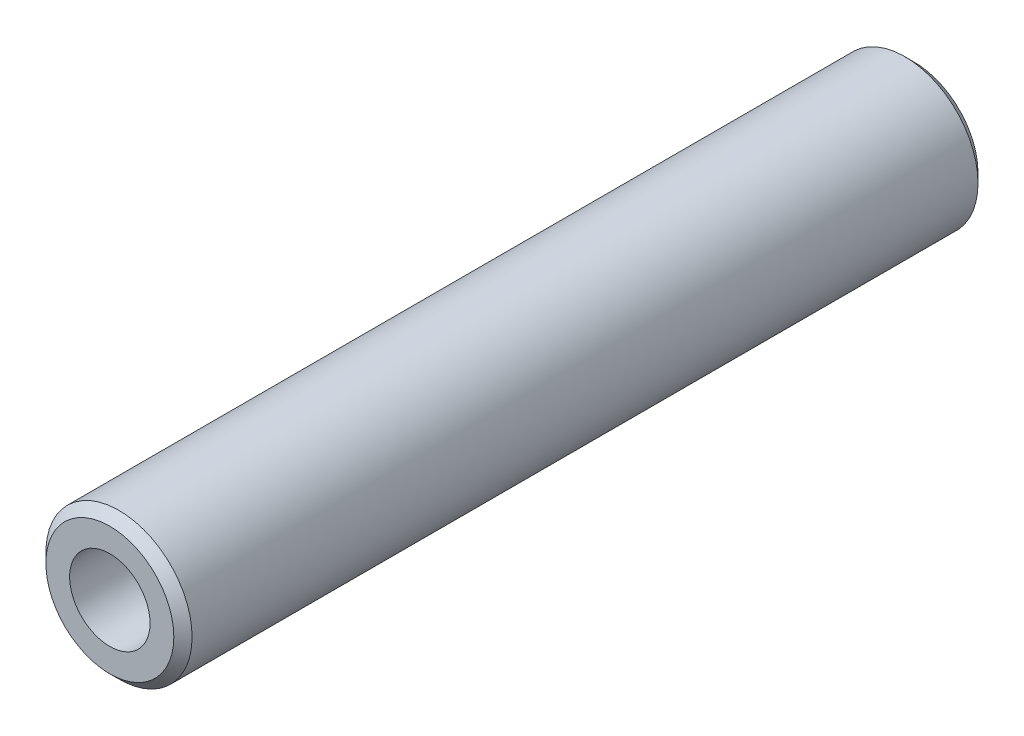
ISO-10303-21;
HEADER;
FILE_DESCRIPTION(('STEP AP214'),'2;1');
FILE_NAME('part.step','',(''),(''),'','','');
FILE_SCHEMA(('AUTOMOTIVE_DESIGN { 1 0 10303 214 1 1 1 1 }'));
ENDSEC;
DATA;
#1=APPLICATION_CONTEXT('core data for automotive mechanical design processes');
#2=APPLICATION_PROTOCOL_DEFINITION('international standard','automotive_design',2000,#1);
#3=PRODUCT_CONTEXT('',#1,'mechanical');
#4=PRODUCT('Part','Part','',(#3));
#5=PRODUCT_RELATED_PRODUCT_CATEGORY('part','',(#4));
#6=PRODUCT_DEFINITION_FORMATION('','',#4);
#7=PRODUCT_DEFINITION_CONTEXT('part definition',#1,'design');
#8=PRODUCT_DEFINITION('design','',#6,#7);
#9=PRODUCT_DEFINITION_SHAPE('','',#8);
#10=(LENGTH_UNIT() NAMED_UNIT(*) SI_UNIT(.MILLI.,.METRE.));
#11=(NAMED_UNIT(*) PLANE_ANGLE_UNIT() SI_UNIT($,.RADIAN.));
#12=(NAMED_UNIT(*) SI_UNIT($,.STERADIAN.) SOLID_ANGLE_UNIT());
#13=UNCERTAINTY_MEASURE_WITH_UNIT(LENGTH_MEASURE(1.E-05),#10,'distance_accuracy_value','');
#14=(GEOMETRIC_REPRESENTATION_CONTEXT(3) GLOBAL_UNCERTAINTY_ASSIGNED_CONTEXT((#13)) GLOBAL_UNIT_ASSIGNED_CONTEXT((#10,
#11,#12)) REPRESENTATION_CONTEXT('',''));
#15=CARTESIAN_POINT('',(0.,0.,0.));
#16=DIRECTION('',(0.,0.,1.));
#17=DIRECTION('',(1.,0.,0.));
#18=AXIS2_PLACEMENT_3D('',#15,#16,#17);
#19=CARTESIAN_POINT('',(0.,0.,22.));
#20=DIRECTION('',(0.,0.,1.));
#21=DIRECTION('',(1.,0.,0.));
#22=AXIS2_PLACEMENT_3D('',#19,#20,#21);
#23=PLANE('',#22);
#24=CARTESIAN_POINT('',(0.,0.,22.));
#25=DIRECTION('',(0.,0.,1.));
#26=DIRECTION('',(1.,0.,0.));
#27=AXIS2_PLACEMENT_3D('',#24,#25,#26);
#28=CIRCLE('',#27,3.50000000000001);
#29=CARTESIAN_POINT('',(3.50000000000001,0.,22.));
#30=VERTEX_POINT('',#29);
#31=EDGE_CURVE('E10',#30,#30,#28,.T.);
#32=ORIENTED_EDGE('',*,*,#31,.T.);
#33=EDGE_LOOP('',(#32));
#34=FACE_BOUND('',#33,.T.);
#35=CARTESIAN_POINT('',(0.,0.,22.));
#36=DIRECTION('',(0.,0.,1.));
#37=DIRECTION('',(1.,0.,0.));
#38=AXIS2_PLACEMENT_3D('',#35,#36,#37);
#39=CIRCLE('',#38,2.2);
#40=CARTESIAN_POINT('',(2.2,0.,22.));
#41=VERTEX_POINT('',#40);
#42=EDGE_CURVE('E50',#41,#41,#39,.T.);
#43=ORIENTED_EDGE('',*,*,#42,.F.);
#44=EDGE_LOOP('',(#43));
#45=FACE_BOUND('',#44,.T.);
#46=ADVANCED_FACE('F30',(#34,#45),#23,.T.);
#47=CARTESIAN_POINT('',(0.,0.,-22.));
#48=DIRECTION('',(0.,0.,1.));
#49=DIRECTION('',(1.,0.,0.));
#50=AXIS2_PLACEMENT_3D('',#47,#48,#49);
#51=PLANE('',#50);
#52=CARTESIAN_POINT('',(0.,0.,-22.));
#53=DIRECTION('',(0.,0.,1.));
#54=DIRECTION('',(1.,0.,0.));
#55=AXIS2_PLACEMENT_3D('',#52,#53,#54);
#56=CIRCLE('',#55,3.5);
#57=CARTESIAN_POINT('',(3.5,0.,-22.));
#58=VERTEX_POINT('',#57);
#59=EDGE_CURVE('E37',#58,#58,#56,.F.);
#60=ORIENTED_EDGE('',*,*,#59,.T.);
#61=EDGE_LOOP('',(#60));
#62=FACE_BOUND('',#61,.T.);
#63=CARTESIAN_POINT('',(0.,0.,-22.));
#64=DIRECTION('',(0.,0.,1.));
#65=DIRECTION('',(1.,0.,0.));
#66=AXIS2_PLACEMENT_3D('',#63,#64,#65);
#67=CIRCLE('',#66,2.2);
#68=CARTESIAN_POINT('',(2.2,0.,-22.));
#69=VERTEX_POINT('',#68);
#70=EDGE_CURVE('E51',#69,#69,#67,.T.);
#71=ORIENTED_EDGE('',*,*,#70,.T.);
#72=EDGE_LOOP('',(#71));
#73=FACE_BOUND('',#72,.T.);
#74=ADVANCED_FACE('F61',(#62,#73),#51,.F.);
#75=CARTESIAN_POINT('',(0.,0.,22.));
#76=DIRECTION('',(0.,0.,-1.));
#77=DIRECTION('',(-1.,0.,0.));
#78=AXIS2_PLACEMENT_3D('',#75,#76,#77);
#79=CYLINDRICAL_SURFACE('',#78,4.);
#80=CARTESIAN_POINT('',(0.,0.,-21.5));
#81=DIRECTION('',(0.,0.,1.));
#82=DIRECTION('',(1.,0.,0.));
#83=AXIS2_PLACEMENT_3D('',#80,#81,#82);
#84=CIRCLE('',#83,4.);
#85=CARTESIAN_POINT('',(4.,0.,-21.5));
#86=VERTEX_POINT('',#85);
#87=EDGE_CURVE('E41',#86,#86,#84,.T.);
#88=ORIENTED_EDGE('',*,*,#87,.T.);
#89=EDGE_LOOP('',(#88));
#90=FACE_BOUND('',#89,.T.);
#91=CARTESIAN_POINT('',(0.,0.,21.5));
#92=DIRECTION('',(0.,0.,1.));
#93=DIRECTION('',(1.,0.,0.));
#94=AXIS2_PLACEMENT_3D('',#91,#92,#93);
#95=CIRCLE('',#94,4.);
#96=CARTESIAN_POINT('',(4.,0.,21.5));
#97=VERTEX_POINT('',#96);
#98=EDGE_CURVE('E45',#97,#97,#95,.F.);
#99=ORIENTED_EDGE('',*,*,#98,.T.);
#100=EDGE_LOOP('',(#99));
#101=FACE_BOUND('',#100,.T.);
#102=ADVANCED_FACE('F66',(#90,#101),#79,.T.);
#103=CARTESIAN_POINT('',(0.,0.,22.));
#104=DIRECTION('',(0.,0.,-1.));
#105=DIRECTION('',(-1.,0.,0.));
#106=AXIS2_PLACEMENT_3D('',#103,#104,#105);
#107=CYLINDRICAL_SURFACE('',#106,2.2);
#108=ORIENTED_EDGE('',*,*,#42,.T.);
#109=EDGE_LOOP('',(#108));
#110=FACE_BOUND('',#109,.T.);
#111=ORIENTED_EDGE('',*,*,#70,.F.);
#112=EDGE_LOOP('',(#111));
#113=FACE_BOUND('',#112,.T.);
#114=ADVANCED_FACE('F57',(#110,#113),#107,.F.);
#115=CARTESIAN_POINT('',(0.,0.,-21.5));
#116=DIRECTION('',(0.,0.,1.));
#117=DIRECTION('',(1.,0.,0.));
#118=AXIS2_PLACEMENT_3D('',#115,#116,#117);
#119=CONICAL_SURFACE('',#118,4.,0.785398163397452);
#120=ORIENTED_EDGE('',*,*,#59,.F.);
#121=EDGE_LOOP('',(#120));
#122=FACE_BOUND('',#121,.T.);
#123=ORIENTED_EDGE('',*,*,#87,.F.);
#124=EDGE_LOOP('',(#123));
#125=FACE_BOUND('',#124,.T.);
#126=ADVANCED_FACE('F72',(#122,#125),#119,.T.);
#127=CARTESIAN_POINT('',(0.,0.,22.));
#128=DIRECTION('',(0.,0.,-1.));
#129=DIRECTION('',(-1.,0.,0.));
#130=AXIS2_PLACEMENT_3D('',#127,#128,#129);
#131=CONICAL_SURFACE('',#130,3.50000000000001,0.785398163397441);
#132=ORIENTED_EDGE('',*,*,#98,.F.);
#133=EDGE_LOOP('',(#132));
#134=FACE_BOUND('',#133,.T.);
#135=ORIENTED_EDGE('',*,*,#31,.F.);
#136=EDGE_LOOP('',(#135));
#137=FACE_BOUND('',#136,.T.);
#138=ADVANCED_FACE('F32',(#134,#137),#131,.T.);
#139=CLOSED_SHELL('',(#46,#74,#102,#114,#126,#138));
#140=MANIFOLD_SOLID_BREP('B2',#139);
#141=ADVANCED_BREP_SHAPE_REPRESENTATION('',(#18,#140),#14);
#142=SHAPE_DEFINITION_REPRESENTATION(#9,#141);
ENDSEC;
END-ISO-10303-21;
